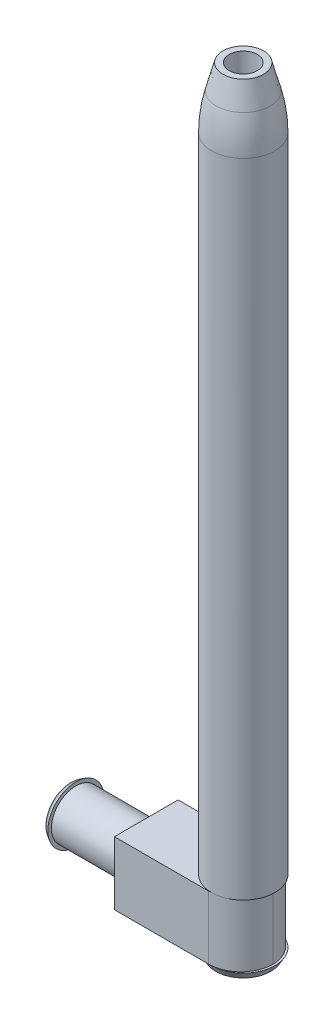
ISO-10303-21;
HEADER;
FILE_DESCRIPTION(('STEP AP214'),'2;1');
FILE_NAME('part.step','',(''),(''),'','','');
FILE_SCHEMA(('AUTOMOTIVE_DESIGN { 1 0 10303 214 1 1 1 1 }'));
ENDSEC;
DATA;
#1=APPLICATION_CONTEXT('core data for automotive mechanical design processes');
#2=APPLICATION_PROTOCOL_DEFINITION('international standard','automotive_design',2000,#1);
#3=PRODUCT_CONTEXT('',#1,'mechanical');
#4=PRODUCT('Part','Part','',(#3));
#5=PRODUCT_RELATED_PRODUCT_CATEGORY('part','',(#4));
#6=PRODUCT_DEFINITION_FORMATION('','',#4);
#7=PRODUCT_DEFINITION_CONTEXT('part definition',#1,'design');
#8=PRODUCT_DEFINITION('design','',#6,#7);
#9=PRODUCT_DEFINITION_SHAPE('','',#8);
#10=(LENGTH_UNIT() NAMED_UNIT(*) SI_UNIT(.MILLI.,.METRE.));
#11=(NAMED_UNIT(*) PLANE_ANGLE_UNIT() SI_UNIT($,.RADIAN.));
#12=(NAMED_UNIT(*) SI_UNIT($,.STERADIAN.) SOLID_ANGLE_UNIT());
#13=UNCERTAINTY_MEASURE_WITH_UNIT(LENGTH_MEASURE(1.E-05),#10,'distance_accuracy_value','');
#14=(GEOMETRIC_REPRESENTATION_CONTEXT(3) GLOBAL_UNCERTAINTY_ASSIGNED_CONTEXT((#13)) GLOBAL_UNIT_ASSIGNED_CONTEXT((#10,
#11,#12)) REPRESENTATION_CONTEXT('',''));
#15=CARTESIAN_POINT('',(0.,0.,0.));
#16=DIRECTION('',(0.,0.,1.));
#17=DIRECTION('',(1.,0.,0.));
#18=AXIS2_PLACEMENT_3D('',#15,#16,#17);
#19=CARTESIAN_POINT('',(29.21,5.715,5.7531));
#20=DIRECTION('',(0.,-1.,0.));
#21=DIRECTION('',(0.,0.,-1.));
#22=AXIS2_PLACEMENT_3D('',#19,#20,#21);
#23=PLANE('',#22);
#24=CARTESIAN_POINT('',(23.876,5.715,0.));
#25=DIRECTION('',(0.,1.,0.));
#26=DIRECTION('',(0.,0.,1.));
#27=AXIS2_PLACEMENT_3D('',#24,#25,#26);
#28=CIRCLE('',#27,5.715);
#29=CARTESIAN_POINT('',(24.0592354385687,5.715,-5.71206177960747));
#30=VERTEX_POINT('',#29);
#31=CARTESIAN_POINT('',(24.0592354385687,5.715,5.71206177960747));
#32=VERTEX_POINT('',#31);
#33=EDGE_CURVE('E50',#30,#32,#28,.T.);
#34=ORIENTED_EDGE('',*,*,#33,.F.);
#35=CARTESIAN_POINT('',(23.368,5.715,0.0889000000000003));
#36=DIRECTION('',(0.,-1.,0.));
#37=DIRECTION('',(0.,0.,-1.));
#38=AXIS2_PLACEMENT_3D('',#35,#36,#37);
#39=CIRCLE('',#38,5.842);
#40=CARTESIAN_POINT('',(23.368,5.715,-5.7531));
#41=VERTEX_POINT('',#40);
#42=EDGE_CURVE('E99',#30,#41,#39,.F.);
#43=ORIENTED_EDGE('',*,*,#42,.T.);
#44=DIRECTION('',(-1.,0.,0.));
#45=VECTOR('',#44,1.);
#46=CARTESIAN_POINT('',(29.21,5.715,-5.7531));
#47=LINE('',#46,#45);
#48=CARTESIAN_POINT('',(6.35,5.715,-5.7531));
#49=VERTEX_POINT('',#48);
#50=EDGE_CURVE('E148',#41,#49,#47,.T.);
#51=ORIENTED_EDGE('',*,*,#50,.T.);
#52=DIRECTION('',(0.,0.,1.));
#53=VECTOR('',#52,1.);
#54=CARTESIAN_POINT('',(6.35,5.715,5.7531));
#55=LINE('',#54,#53);
#56=CARTESIAN_POINT('',(6.35,5.715,5.7531));
#57=VERTEX_POINT('',#56);
#58=EDGE_CURVE('E135',#49,#57,#55,.T.);
#59=ORIENTED_EDGE('',*,*,#58,.T.);
#60=DIRECTION('',(-1.,0.,0.));
#61=VECTOR('',#60,1.);
#62=CARTESIAN_POINT('',(29.21,5.715,5.7531));
#63=LINE('',#62,#61);
#64=CARTESIAN_POINT('',(23.368,5.715,5.7531));
#65=VERTEX_POINT('',#64);
#66=EDGE_CURVE('E96',#65,#57,#63,.T.);
#67=ORIENTED_EDGE('',*,*,#66,.F.);
#68=CARTESIAN_POINT('',(23.368,5.715,-0.0889000000000003));
#69=DIRECTION('',(0.,-1.,0.));
#70=DIRECTION('',(0.,0.,-1.));
#71=AXIS2_PLACEMENT_3D('',#68,#69,#70);
#72=CIRCLE('',#71,5.842);
#73=EDGE_CURVE('E93',#65,#32,#72,.F.);
#74=ORIENTED_EDGE('',*,*,#73,.T.);
#75=EDGE_LOOP('',(#34,#43,#51,#59,#67,#74));
#76=FACE_BOUND('',#75,.T.);
#77=ADVANCED_FACE('F35',(#76),#23,.F.);
#78=CARTESIAN_POINT('',(29.21,-5.715,5.7531));
#79=DIRECTION('',(0.,1.,0.));
#80=DIRECTION('',(0.,0.,1.));
#81=AXIS2_PLACEMENT_3D('',#78,#79,#80);
#82=PLANE('',#81);
#83=CARTESIAN_POINT('',(23.876,-5.715,0.));
#84=DIRECTION('',(0.,-1.,0.));
#85=DIRECTION('',(0.,0.,-1.));
#86=AXIS2_PLACEMENT_3D('',#83,#84,#85);
#87=CIRCLE('',#86,5.715);
#88=CARTESIAN_POINT('',(24.0592354385687,-5.715,5.71206177960747));
#89=VERTEX_POINT('',#88);
#90=CARTESIAN_POINT('',(24.0592354385687,-5.715,-5.71206177960747));
#91=VERTEX_POINT('',#90);
#92=EDGE_CURVE('E58',#89,#91,#87,.T.);
#93=ORIENTED_EDGE('',*,*,#92,.F.);
#94=CARTESIAN_POINT('',(23.368,-5.715,-0.0889000000000003));
#95=DIRECTION('',(0.,1.,0.));
#96=DIRECTION('',(0.,0.,1.));
#97=AXIS2_PLACEMENT_3D('',#94,#95,#96);
#98=CIRCLE('',#97,5.842);
#99=CARTESIAN_POINT('',(23.368,-5.715,5.7531));
#100=VERTEX_POINT('',#99);
#101=EDGE_CURVE('E168',#89,#100,#98,.F.);
#102=ORIENTED_EDGE('',*,*,#101,.T.);
#103=DIRECTION('',(-1.,0.,0.));
#104=VECTOR('',#103,1.);
#105=CARTESIAN_POINT('',(29.21,-5.715,5.7531));
#106=LINE('',#105,#104);
#107=CARTESIAN_POINT('',(6.35,-5.715,5.7531));
#108=VERTEX_POINT('',#107);
#109=EDGE_CURVE('E145',#100,#108,#106,.T.);
#110=ORIENTED_EDGE('',*,*,#109,.T.);
#111=DIRECTION('',(0.,0.,-1.));
#112=VECTOR('',#111,1.);
#113=CARTESIAN_POINT('',(6.35,-5.715,5.7531));
#114=LINE('',#113,#112);
#115=CARTESIAN_POINT('',(6.35,-5.715,-5.7531));
#116=VERTEX_POINT('',#115);
#117=EDGE_CURVE('E140',#108,#116,#114,.T.);
#118=ORIENTED_EDGE('',*,*,#117,.T.);
#119=DIRECTION('',(-1.,0.,0.));
#120=VECTOR('',#119,1.);
#121=CARTESIAN_POINT('',(29.21,-5.715,-5.7531));
#122=LINE('',#121,#120);
#123=CARTESIAN_POINT('',(23.368,-5.715,-5.7531));
#124=VERTEX_POINT('',#123);
#125=EDGE_CURVE('E143',#124,#116,#122,.T.);
#126=ORIENTED_EDGE('',*,*,#125,.F.);
#127=CARTESIAN_POINT('',(23.368,-5.715,0.0889000000000003));
#128=DIRECTION('',(0.,1.,0.));
#129=DIRECTION('',(0.,0.,1.));
#130=AXIS2_PLACEMENT_3D('',#127,#128,#129);
#131=CIRCLE('',#130,5.842);
#132=EDGE_CURVE('E173',#124,#91,#131,.F.);
#133=ORIENTED_EDGE('',*,*,#132,.T.);
#134=EDGE_LOOP('',(#93,#102,#110,#118,#126,#133));
#135=FACE_BOUND('',#134,.T.);
#136=ADVANCED_FACE('F193',(#135),#82,.F.);
#137=CARTESIAN_POINT('',(6.35,0.,0.));
#138=DIRECTION('',(-1.,0.,0.));
#139=DIRECTION('',(0.,0.,1.));
#140=AXIS2_PLACEMENT_3D('',#137,#138,#139);
#141=CYLINDRICAL_SURFACE('',#140,4.445);
#142=CARTESIAN_POINT('',(6.35,0.,0.));
#143=DIRECTION('',(1.,0.,0.));
#144=DIRECTION('',(0.,0.,-1.));
#145=AXIS2_PLACEMENT_3D('',#142,#143,#144);
#146=CIRCLE('',#145,4.445);
#147=CARTESIAN_POINT('',(6.35,0.,4.445));
#148=VERTEX_POINT('',#147);
#149=EDGE_CURVE('E156',#148,#148,#146,.T.);
#150=CARTESIAN_POINT('',(-6.35,0.,0.));
#151=DIRECTION('',(-1.,0.,0.));
#152=DIRECTION('',(0.,0.,1.));
#153=AXIS2_PLACEMENT_3D('',#150,#151,#152);
#154=CIRCLE('',#153,4.445);
#155=CARTESIAN_POINT('',(-6.35,0.,4.445));
#156=VERTEX_POINT('',#155);
#157=EDGE_CURVE('E153',#156,#156,#154,.T.);
#158=CARTESIAN_POINT('',(6.35,0.,4.445));
#159=CARTESIAN_POINT('',(6.21770833333333,0.,4.445));
#160=CARTESIAN_POINT('',(6.08541666666667,0.,4.445));
#161=CARTESIAN_POINT('',(5.82083333333333,0.,4.445));
#162=CARTESIAN_POINT('',(5.68854166666667,0.,4.445));
#163=CARTESIAN_POINT('',(5.42395833333333,0.,4.445));
#164=CARTESIAN_POINT('',(5.29166666666667,0.,4.445));
#165=CARTESIAN_POINT('',(5.02708333333333,0.,4.445));
#166=CARTESIAN_POINT('',(4.89479166666667,0.,4.445));
#167=CARTESIAN_POINT('',(4.63020833333333,0.,4.445));
#168=CARTESIAN_POINT('',(4.49791666666667,0.,4.445));
#169=CARTESIAN_POINT('',(4.23333333333333,0.,4.445));
#170=CARTESIAN_POINT('',(4.10104166666667,0.,4.445));
#171=CARTESIAN_POINT('',(3.83645833333333,0.,4.445));
#172=CARTESIAN_POINT('',(3.70416666666667,0.,4.445));
#173=CARTESIAN_POINT('',(3.43958333333333,0.,4.445));
#174=CARTESIAN_POINT('',(3.30729166666667,0.,4.445));
#175=CARTESIAN_POINT('',(3.04270833333333,0.,4.445));
#176=CARTESIAN_POINT('',(2.91041666666667,0.,4.445));
#177=CARTESIAN_POINT('',(2.64583333333333,0.,4.445));
#178=CARTESIAN_POINT('',(2.51354166666667,0.,4.445));
#179=CARTESIAN_POINT('',(2.24895833333333,0.,4.445));
#180=CARTESIAN_POINT('',(2.11666666666667,0.,4.445));
#181=CARTESIAN_POINT('',(1.85208333333333,0.,4.445));
#182=CARTESIAN_POINT('',(1.71979166666667,0.,4.445));
#183=CARTESIAN_POINT('',(1.45520833333333,0.,4.445));
#184=CARTESIAN_POINT('',(1.32291666666667,0.,4.445));
#185=CARTESIAN_POINT('',(1.05833333333333,0.,4.445));
#186=CARTESIAN_POINT('',(0.926041666666666,0.,4.445));
#187=CARTESIAN_POINT('',(0.661458333333332,0.,4.445));
#188=CARTESIAN_POINT('',(0.529166666666666,0.,4.445));
#189=CARTESIAN_POINT('',(0.264583333333332,0.,4.445));
#190=CARTESIAN_POINT('',(0.132291666666666,0.,4.445));
#191=CARTESIAN_POINT('',(-0.132291666666667,0.,4.445));
#192=CARTESIAN_POINT('',(-0.264583333333334,0.,4.445));
#193=CARTESIAN_POINT('',(-0.529166666666667,0.,4.445));
#194=CARTESIAN_POINT('',(-0.661458333333334,0.,4.445));
#195=CARTESIAN_POINT('',(-0.926041666666668,0.,4.445));
#196=CARTESIAN_POINT('',(-1.05833333333333,0.,4.445));
#197=CARTESIAN_POINT('',(-1.32291666666667,0.,4.445));
#198=CARTESIAN_POINT('',(-1.45520833333333,0.,4.445));
#199=CARTESIAN_POINT('',(-1.71979166666667,0.,4.445));
#200=CARTESIAN_POINT('',(-1.85208333333333,0.,4.445));
#201=CARTESIAN_POINT('',(-2.11666666666667,0.,4.445));
#202=CARTESIAN_POINT('',(-2.24895833333333,0.,4.445));
#203=CARTESIAN_POINT('',(-2.51354166666667,0.,4.445));
#204=CARTESIAN_POINT('',(-2.64583333333333,0.,4.445));
#205=CARTESIAN_POINT('',(-2.91041666666667,0.,4.445));
#206=CARTESIAN_POINT('',(-3.04270833333333,0.,4.445));
#207=CARTESIAN_POINT('',(-3.30729166666667,0.,4.445));
#208=CARTESIAN_POINT('',(-3.43958333333333,0.,4.445));
#209=CARTESIAN_POINT('',(-3.70416666666667,0.,4.445));
#210=CARTESIAN_POINT('',(-3.83645833333333,0.,4.445));
#211=CARTESIAN_POINT('',(-4.10104166666667,0.,4.445));
#212=CARTESIAN_POINT('',(-4.23333333333333,0.,4.445));
#213=CARTESIAN_POINT('',(-4.49791666666667,0.,4.445));
#214=CARTESIAN_POINT('',(-4.63020833333333,0.,4.445));
#215=CARTESIAN_POINT('',(-4.89479166666667,0.,4.445));
#216=CARTESIAN_POINT('',(-5.02708333333333,0.,4.445));
#217=CARTESIAN_POINT('',(-5.29166666666667,0.,4.445));
#218=CARTESIAN_POINT('',(-5.42395833333333,0.,4.445));
#219=CARTESIAN_POINT('',(-5.68854166666667,0.,4.445));
#220=CARTESIAN_POINT('',(-5.82083333333333,0.,4.445));
#221=CARTESIAN_POINT('',(-6.08541666666667,0.,4.445));
#222=CARTESIAN_POINT('',(-6.21770833333333,0.,4.445));
#223=CARTESIAN_POINT('',(-6.35,0.,4.445));
#224=B_SPLINE_CURVE_WITH_KNOTS('',3,(#158,#159,#160,#161,#162,#163,#164,#165,#166,#167,#168,
#169,#170,#171,#172,#173,#174,#175,#176,#177,#178,#179,#180,#181,#182,#183,#184,#185,#186,#187,
#188,#189,#190,#191,#192,#193,#194,#195,#196,#197,#198,#199,#200,#201,#202,#203,#204,#205,#206,
#207,#208,#209,#210,#211,#212,#213,#214,#215,#216,#217,#218,#219,#220,#221,#222,#223),
.UNSPECIFIED.,.F.,.F.,(4,2,2,2,2,2,2,2,2,2,2,2,2,2,2,2,2,2,2,2,2,2,2,2,2,2,2,2,2,2,2,2,4),(0.,
0.396875,0.793749999999999,1.190625,1.5875,1.984375,2.38125,2.778125,3.175,3.571875,3.96875,
4.365625,4.7625,5.159375,5.55625,5.953125,6.35,6.746875,7.14375,7.540625,7.9375,8.334375,
8.73125,9.128125,9.525,9.921875,10.31875,10.715625,11.1125,11.509375,11.90625,12.303125,12.7),.UNSPECIFIED.);
#225=EDGE_CURVE('BSEAM199',#148,#156,#224,.T.);
#226=ORIENTED_EDGE('',*,*,#149,.F.);
#227=ORIENTED_EDGE('',*,*,#157,.F.);
#228=ORIENTED_EDGE('',*,*,#225,.T.);
#229=ORIENTED_EDGE('',*,*,#225,.F.);
#230=EDGE_LOOP('',(#226,#228,#227,#229));
#231=FACE_BOUND('',#230,.T.);
#232=ADVANCED_FACE('F199',(#231),#141,.T.);
#233=CARTESIAN_POINT('',(-6.35,0.,0.));
#234=DIRECTION('',(-1.,0.,0.));
#235=DIRECTION('',(0.,0.,1.));
#236=AXIS2_PLACEMENT_3D('',#233,#234,#235);
#237=PLANE('',#236);
#238=CARTESIAN_POINT('',(-6.35,0.,0.));
#239=DIRECTION('',(-1.,0.,0.));
#240=DIRECTION('',(0.,0.,1.));
#241=AXIS2_PLACEMENT_3D('',#238,#239,#240);
#242=CIRCLE('',#241,5.08);
#243=CARTESIAN_POINT('',(-6.35,0.,5.08));
#244=VERTEX_POINT('',#243);
#245=EDGE_CURVE('E150',#244,#244,#242,.T.);
#246=ORIENTED_EDGE('',*,*,#245,.F.);
#247=EDGE_LOOP('',(#246));
#248=FACE_BOUND('',#247,.T.);
#249=ORIENTED_EDGE('',*,*,#157,.T.);
#250=EDGE_LOOP('',(#249));
#251=FACE_BOUND('',#250,.T.);
#252=ADVANCED_FACE('F215',(#248,#251),#237,.F.);
#253=CARTESIAN_POINT('',(-6.35,0.,0.));
#254=DIRECTION('',(1.,0.,0.));
#255=DIRECTION('',(0.,0.,1.));
#256=AXIS2_PLACEMENT_3D('',#253,#254,#255);
#257=CONICAL_SURFACE('',#256,5.08,0.5235987755983);
#258=CARTESIAN_POINT('',(-6.985,0.,0.));
#259=DIRECTION('',(1.,0.,0.));
#260=DIRECTION('',(0.,0.,-1.));
#261=AXIS2_PLACEMENT_3D('',#258,#259,#260);
#262=CIRCLE('',#261,4.71338257906459);
#263=CARTESIAN_POINT('',(-6.985,0.,-4.71338257906459));
#264=VERTEX_POINT('',#263);
#265=EDGE_CURVE('E110',#264,#264,#262,.T.);
#266=ORIENTED_EDGE('',*,*,#265,.T.);
#267=EDGE_LOOP('',(#266));
#268=FACE_BOUND('',#267,.T.);
#269=ORIENTED_EDGE('',*,*,#245,.T.);
#270=EDGE_LOOP('',(#269));
#271=FACE_BOUND('',#270,.T.);
#272=ADVANCED_FACE('F213',(#268,#271),#257,.T.);
#273=CARTESIAN_POINT('',(-7.62,0.,0.));
#274=DIRECTION('',(-1.,0.,0.));
#275=DIRECTION('',(0.,0.,1.));
#276=AXIS2_PLACEMENT_3D('',#273,#274,#275);
#277=PLANE('',#276);
#278=CARTESIAN_POINT('',(-7.62,0.,0.));
#279=DIRECTION('',(-1.,0.,0.));
#280=DIRECTION('',(0.,0.,1.));
#281=AXIS2_PLACEMENT_3D('',#278,#279,#280);
#282=CIRCLE('',#281,3.61353031625835);
#283=CARTESIAN_POINT('',(-7.62,0.,3.61353031625835));
#284=VERTEX_POINT('',#283);
#285=EDGE_CURVE('E159',#284,#284,#282,.T.);
#286=ORIENTED_EDGE('',*,*,#285,.T.);
#287=EDGE_LOOP('',(#286));
#288=FACE_BOUND('',#287,.T.);
#289=ADVANCED_FACE('F209',(#288),#277,.T.);
#290=CARTESIAN_POINT('',(-6.35,0.,0.));
#291=DIRECTION('',(-1.,0.,0.));
#292=DIRECTION('',(0.,0.,1.));
#293=AXIS2_PLACEMENT_3D('',#290,#291,#292);
#294=TOROIDAL_SURFACE('',#293,3.61353031625835,1.27);
#295=ORIENTED_EDGE('',*,*,#265,.F.);
#296=EDGE_LOOP('',(#295));
#297=FACE_BOUND('',#296,.T.);
#298=ORIENTED_EDGE('',*,*,#285,.F.);
#299=EDGE_LOOP('',(#298));
#300=FACE_BOUND('',#299,.T.);
#301=ADVANCED_FACE('F212',(#297,#300),#294,.T.);
#302=CARTESIAN_POINT('',(6.35,0.,0.));
#303=DIRECTION('',(-1.,0.,0.));
#304=DIRECTION('',(0.,0.,1.));
#305=AXIS2_PLACEMENT_3D('',#302,#303,#304);
#306=PLANE('',#305);
#307=DIRECTION('',(0.,1.,0.));
#308=VECTOR('',#307,1.);
#309=CARTESIAN_POINT('',(6.35,-5.715,-5.7531));
#310=LINE('',#309,#308);
#311=EDGE_CURVE('E132',#116,#49,#310,.T.);
#312=ORIENTED_EDGE('',*,*,#311,.F.);
#313=ORIENTED_EDGE('',*,*,#117,.F.);
#314=DIRECTION('',(0.,-1.,0.));
#315=VECTOR('',#314,1.);
#316=CARTESIAN_POINT('',(6.35,-5.715,5.7531));
#317=LINE('',#316,#315);
#318=EDGE_CURVE('E137',#57,#108,#317,.T.);
#319=ORIENTED_EDGE('',*,*,#318,.F.);
#320=ORIENTED_EDGE('',*,*,#58,.F.);
#321=EDGE_LOOP('',(#312,#313,#319,#320));
#322=FACE_BOUND('',#321,.T.);
#323=ORIENTED_EDGE('',*,*,#149,.T.);
#324=EDGE_LOOP('',(#323));
#325=FACE_BOUND('',#324,.T.);
#326=ADVANCED_FACE('F207',(#322,#325),#306,.T.);
#327=CARTESIAN_POINT('',(29.21,-5.715,-5.7531));
#328=DIRECTION('',(0.,0.,1.));
#329=DIRECTION('',(1.,0.,0.));
#330=AXIS2_PLACEMENT_3D('',#327,#328,#329);
#331=PLANE('',#330);
#332=ORIENTED_EDGE('',*,*,#50,.F.);
#333=DIRECTION('',(0.,1.,0.));
#334=VECTOR('',#333,1.);
#335=CARTESIAN_POINT('',(23.368,-5.715,-5.7531));
#336=LINE('',#335,#334);
#337=EDGE_CURVE('E165',#41,#124,#336,.F.);
#338=ORIENTED_EDGE('',*,*,#337,.T.);
#339=ORIENTED_EDGE('',*,*,#125,.T.);
#340=ORIENTED_EDGE('',*,*,#311,.T.);
#341=EDGE_LOOP('',(#332,#338,#339,#340));
#342=FACE_BOUND('',#341,.T.);
#343=ADVANCED_FACE('F204',(#342),#331,.F.);
#344=CARTESIAN_POINT('',(29.21,-5.715,5.7531));
#345=DIRECTION('',(0.,0.,-1.));
#346=DIRECTION('',(-1.,0.,0.));
#347=AXIS2_PLACEMENT_3D('',#344,#345,#346);
#348=PLANE('',#347);
#349=ORIENTED_EDGE('',*,*,#109,.F.);
#350=DIRECTION('',(0.,-1.,0.));
#351=VECTOR('',#350,1.);
#352=CARTESIAN_POINT('',(23.368,-5.715,5.7531));
#353=LINE('',#352,#351);
#354=EDGE_CURVE('E175',#100,#65,#353,.F.);
#355=ORIENTED_EDGE('',*,*,#354,.T.);
#356=ORIENTED_EDGE('',*,*,#66,.T.);
#357=ORIENTED_EDGE('',*,*,#318,.T.);
#358=EDGE_LOOP('',(#349,#355,#356,#357));
#359=FACE_BOUND('',#358,.T.);
#360=ADVANCED_FACE('F203',(#359),#348,.F.);
#361=CARTESIAN_POINT('',(23.368,0.,-0.0889000000000003));
#362=DIRECTION('',(0.,-1.,0.));
#363=DIRECTION('',(0.,0.,-1.));
#364=AXIS2_PLACEMENT_3D('',#361,#362,#363);
#365=CYLINDRICAL_SURFACE('',#364,5.842);
#366=ORIENTED_EDGE('',*,*,#354,.F.);
#367=ORIENTED_EDGE('',*,*,#101,.F.);
#368=CARTESIAN_POINT('',(29.2093235477929,-5.715,0.));
#369=VERTEX_POINT('',#368);
#370=EDGE_CURVE('E169',#369,#89,#98,.F.);
#371=ORIENTED_EDGE('',*,*,#370,.F.);
#372=DIRECTION('',(0.,-1.,0.));
#373=VECTOR('',#372,1.);
#374=CARTESIAN_POINT('',(29.2093235477929,0.,0.));
#375=LINE('',#374,#373);
#376=CARTESIAN_POINT('',(29.2093235477929,5.715,0.));
#377=VERTEX_POINT('',#376);
#378=EDGE_CURVE('E105',#377,#369,#375,.T.);
#379=ORIENTED_EDGE('',*,*,#378,.F.);
#380=EDGE_CURVE('E100',#32,#377,#72,.F.);
#381=ORIENTED_EDGE('',*,*,#380,.F.);
#382=ORIENTED_EDGE('',*,*,#73,.F.);
#383=EDGE_LOOP('',(#366,#367,#371,#379,#381,#382));
#384=FACE_BOUND('',#383,.T.);
#385=ADVANCED_FACE('F103',(#384),#365,.T.);
#386=CARTESIAN_POINT('',(23.368,0.,0.0889000000000003));
#387=DIRECTION('',(0.,1.,0.));
#388=DIRECTION('',(0.,0.,1.));
#389=AXIS2_PLACEMENT_3D('',#386,#387,#388);
#390=CYLINDRICAL_SURFACE('',#389,5.842);
#391=ORIENTED_EDGE('',*,*,#132,.F.);
#392=ORIENTED_EDGE('',*,*,#337,.F.);
#393=ORIENTED_EDGE('',*,*,#42,.F.);
#394=EDGE_CURVE('E118',#377,#30,#39,.F.);
#395=ORIENTED_EDGE('',*,*,#394,.F.);
#396=ORIENTED_EDGE('',*,*,#378,.T.);
#397=EDGE_CURVE('E172',#91,#369,#131,.F.);
#398=ORIENTED_EDGE('',*,*,#397,.F.);
#399=EDGE_LOOP('',(#391,#392,#393,#395,#396,#398));
#400=FACE_BOUND('',#399,.T.);
#401=ADVANCED_FACE('F228',(#400),#390,.T.);
#402=CARTESIAN_POINT('',(23.876,-6.985,0.));
#403=DIRECTION('',(0.,-1.,0.));
#404=DIRECTION('',(0.,0.,-1.));
#405=AXIS2_PLACEMENT_3D('',#402,#403,#404);
#406=PLANE('',#405);
#407=CARTESIAN_POINT('',(23.876,-6.985,0.));
#408=DIRECTION('',(0.,-1.,0.));
#409=DIRECTION('',(0.,0.,-1.));
#410=AXIS2_PLACEMENT_3D('',#407,#408,#409);
#411=CIRCLE('',#410,4.98176515812917);
#412=CARTESIAN_POINT('',(23.876,-6.985,-4.98176515812917));
#413=VERTEX_POINT('',#412);
#414=EDGE_CURVE('E122',#413,#413,#411,.T.);
#415=ORIENTED_EDGE('',*,*,#414,.T.);
#416=EDGE_LOOP('',(#415));
#417=FACE_BOUND('',#416,.T.);
#418=ADVANCED_FACE('F231',(#417),#406,.T.);
#419=CARTESIAN_POINT('',(23.876,-5.715,0.));
#420=DIRECTION('',(0.,1.,0.));
#421=DIRECTION('',(0.,0.,-1.));
#422=AXIS2_PLACEMENT_3D('',#419,#420,#421);
#423=CONICAL_SURFACE('',#422,5.715,0.5235987755983);
#424=ORIENTED_EDGE('',*,*,#414,.F.);
#425=EDGE_LOOP('',(#424));
#426=FACE_BOUND('',#425,.T.);
#427=EDGE_CURVE('E119',#91,#89,#87,.T.);
#428=ORIENTED_EDGE('',*,*,#427,.T.);
#429=ORIENTED_EDGE('',*,*,#92,.T.);
#430=EDGE_LOOP('',(#428,#429));
#431=FACE_BOUND('',#430,.T.);
#432=ADVANCED_FACE('F248',(#426,#431),#423,.T.);
#433=CARTESIAN_POINT('',(23.876,-5.715,0.));
#434=DIRECTION('',(0.,-1.,0.));
#435=DIRECTION('',(0.,0.,-1.));
#436=AXIS2_PLACEMENT_3D('',#433,#434,#435);
#437=PLANE('',#436);
#438=ORIENTED_EDGE('',*,*,#427,.F.);
#439=ORIENTED_EDGE('',*,*,#397,.T.);
#440=ORIENTED_EDGE('',*,*,#370,.T.);
#441=EDGE_LOOP('',(#438,#439,#440));
#442=FACE_BOUND('',#441,.T.);
#443=ADVANCED_FACE('F245',(#442),#437,.F.);
#444=CARTESIAN_POINT('',(23.876,5.715,0.));
#445=DIRECTION('',(0.,1.,0.));
#446=DIRECTION('',(0.,0.,1.));
#447=AXIS2_PLACEMENT_3D('',#444,#445,#446);
#448=PLANE('',#447);
#449=EDGE_CURVE('E114',#32,#30,#28,.T.);
#450=ORIENTED_EDGE('',*,*,#449,.F.);
#451=ORIENTED_EDGE('',*,*,#380,.T.);
#452=ORIENTED_EDGE('',*,*,#394,.T.);
#453=EDGE_LOOP('',(#450,#451,#452));
#454=FACE_BOUND('',#453,.T.);
#455=ADVANCED_FACE('F117',(#454),#448,.F.);
#456=CARTESIAN_POINT('',(23.876,132.715,0.));
#457=DIRECTION('',(0.,1.,0.));
#458=DIRECTION('',(0.,0.,1.));
#459=AXIS2_PLACEMENT_3D('',#456,#457,#458);
#460=PLANE('',#459);
#461=CARTESIAN_POINT('',(23.876,132.715,0.));
#462=DIRECTION('',(0.,1.,0.));
#463=DIRECTION('',(0.,0.,1.));
#464=AXIS2_PLACEMENT_3D('',#461,#462,#463);
#465=CIRCLE('',#464,3.67322715367487);
#466=CARTESIAN_POINT('',(23.876,132.715,3.67322715367487));
#467=VERTEX_POINT('',#466);
#468=EDGE_CURVE('E115',#467,#467,#465,.T.);
#469=ORIENTED_EDGE('',*,*,#468,.T.);
#470=EDGE_LOOP('',(#469));
#471=FACE_BOUND('',#470,.T.);
#472=CARTESIAN_POINT('',(23.876,132.715,0.));
#473=DIRECTION('',(0.,1.,0.));
#474=DIRECTION('',(0.,0.,1.));
#475=AXIS2_PLACEMENT_3D('',#472,#473,#474);
#476=CIRCLE('',#475,2.54);
#477=CARTESIAN_POINT('',(23.876,132.715,2.54));
#478=VERTEX_POINT('',#477);
#479=EDGE_CURVE('E120',#478,#478,#476,.T.);
#480=ORIENTED_EDGE('',*,*,#479,.F.);
#481=EDGE_LOOP('',(#480));
#482=FACE_BOUND('',#481,.T.);
#483=ADVANCED_FACE('F347',(#471,#482),#460,.T.);
#484=CARTESIAN_POINT('',(23.876,132.715,0.));
#485=DIRECTION('',(0.,-1.,0.));
#486=DIRECTION('',(0.,0.,-1.));
#487=AXIS2_PLACEMENT_3D('',#484,#485,#486);
#488=CYLINDRICAL_SURFACE('',#487,5.715);
#489=CARTESIAN_POINT('',(23.876,121.75102656128,0.));
#490=DIRECTION('',(0.,1.,0.));
#491=DIRECTION('',(0.,0.,1.));
#492=AXIS2_PLACEMENT_3D('',#489,#490,#491);
#493=CIRCLE('',#492,5.715);
#494=CARTESIAN_POINT('',(23.876,121.75102656128,5.715));
#495=VERTEX_POINT('',#494);
#496=EDGE_CURVE('E43',#495,#495,#493,.F.);
#497=ORIENTED_EDGE('',*,*,#496,.T.);
#498=EDGE_LOOP('',(#497));
#499=FACE_BOUND('',#498,.T.);
#500=ORIENTED_EDGE('',*,*,#449,.T.);
#501=ORIENTED_EDGE('',*,*,#33,.T.);
#502=EDGE_LOOP('',(#500,#501));
#503=FACE_BOUND('',#502,.T.);
#504=ADVANCED_FACE('F113',(#499,#503),#488,.T.);
#505=CARTESIAN_POINT('',(23.876,-5.715,0.));
#506=DIRECTION('',(0.,1.,0.));
#507=DIRECTION('',(0.,0.,1.));
#508=AXIS2_PLACEMENT_3D('',#505,#506,#507);
#509=CIRCLE('',#508,2.54);
#510=CARTESIAN_POINT('',(23.876,-5.715,2.54));
#511=VERTEX_POINT('',#510);
#512=EDGE_CURVE('E129',#511,#511,#509,.F.);
#513=ORIENTED_EDGE('',*,*,#512,.F.);
#514=EDGE_LOOP('',(#513));
#515=FACE_BOUND('',#514,.T.);
#516=ADVANCED_FACE('F257',(#515),#437,.F.);
#517=CARTESIAN_POINT('',(23.876,-5.716,0.));
#518=DIRECTION('',(0.,1.,0.));
#519=DIRECTION('',(0.,0.,1.));
#520=AXIS2_PLACEMENT_3D('',#517,#518,#519);
#521=CYLINDRICAL_SURFACE('',#520,2.54);
#522=ORIENTED_EDGE('',*,*,#512,.T.);
#523=EDGE_LOOP('',(#522));
#524=FACE_BOUND('',#523,.T.);
#525=ORIENTED_EDGE('',*,*,#479,.T.);
#526=EDGE_LOOP('',(#525));
#527=FACE_BOUND('',#526,.T.);
#528=ADVANCED_FACE('F189',(#524,#527),#521,.F.);
#529=CARTESIAN_POINT('',(23.876,132.715,0.));
#530=DIRECTION('',(0.,-1.,0.));
#531=DIRECTION('',(0.,0.,-1.));
#532=AXIS2_PLACEMENT_3D('',#529,#530,#531);
#533=CONICAL_SURFACE('',#532,3.67322715367487,0.261799387799147);
#534=CARTESIAN_POINT('',(23.876,128.325030306884,0.));
#535=DIRECTION('',(0.,-1.,0.));
#536=DIRECTION('',(0.,0.,-1.));
#537=AXIS2_PLACEMENT_3D('',#534,#535,#536);
#538=CIRCLE('',#537,4.84951598774235);
#539=CARTESIAN_POINT('',(23.876,128.325030306884,-4.84951598774235));
#540=VERTEX_POINT('',#539);
#541=EDGE_CURVE('E11',#540,#540,#538,.F.);
#542=ORIENTED_EDGE('',*,*,#541,.T.);
#543=EDGE_LOOP('',(#542));
#544=FACE_BOUND('',#543,.T.);
#545=ORIENTED_EDGE('',*,*,#468,.F.);
#546=EDGE_LOOP('',(#545));
#547=FACE_BOUND('',#546,.T.);
#548=ADVANCED_FACE('F184',(#544,#547),#533,.T.);
#549=CARTESIAN_POINT('',(23.876,121.75102656128,0.));
#550=DIRECTION('',(0.,1.,0.));
#551=DIRECTION('',(0.,0.,1.));
#552=AXIS2_PLACEMENT_3D('',#549,#550,#551);
#553=DEGENERATE_TOROIDAL_SURFACE('',#552,19.685,25.4,.F.);
#554=ORIENTED_EDGE('',*,*,#541,.F.);
#555=EDGE_LOOP('',(#554));
#556=FACE_BOUND('',#555,.T.);
#557=ORIENTED_EDGE('',*,*,#496,.F.);
#558=EDGE_LOOP('',(#557));
#559=FACE_BOUND('',#558,.T.);
#560=ADVANCED_FACE('F37',(#556,#559),#553,.F.);
#561=CLOSED_SHELL('',(#77,#136,#232,#252,#272,#289,#301,#326,#343,#360,#385,#401,#418,#432,#443,
#455,#483,#504,#516,#528,#548,#560));
#562=MANIFOLD_SOLID_BREP('B2',#561);
#563=ADVANCED_BREP_SHAPE_REPRESENTATION('',(#18,#562),#14);
#564=SHAPE_DEFINITION_REPRESENTATION(#9,#563);
ENDSEC;
END-ISO-10303-21;
